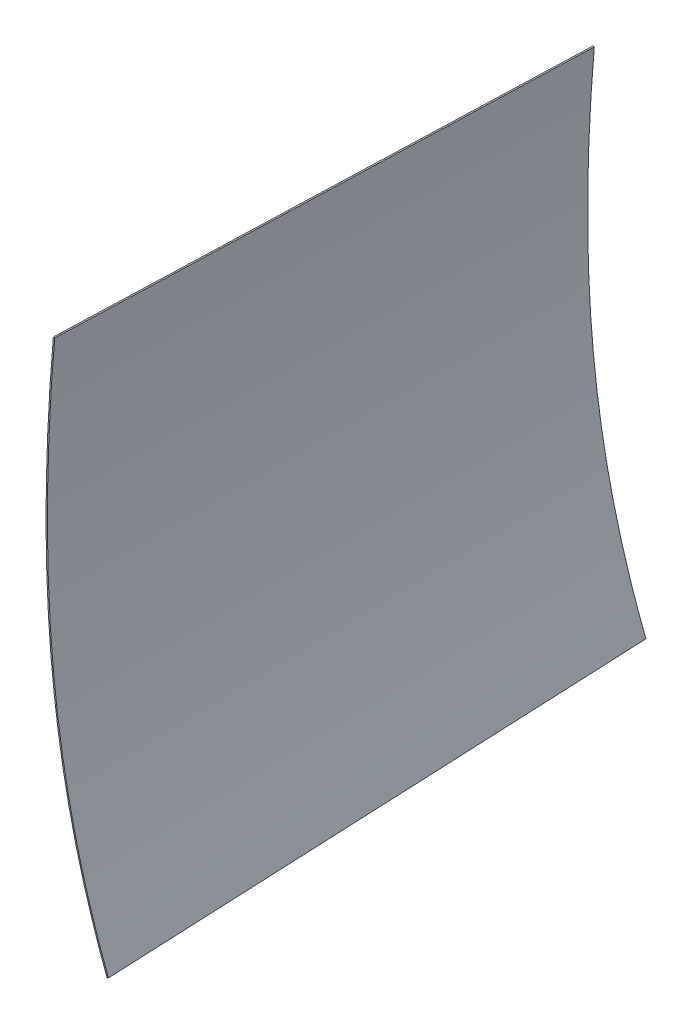
ISO-10303-21;
HEADER;
FILE_DESCRIPTION(('STEP AP214'),'2;1');
FILE_NAME('part.step','',(''),(''),'','','');
FILE_SCHEMA(('AUTOMOTIVE_DESIGN { 1 0 10303 214 1 1 1 1 }'));
ENDSEC;
DATA;
#1=APPLICATION_CONTEXT('core data for automotive mechanical design processes');
#2=APPLICATION_PROTOCOL_DEFINITION('international standard','automotive_design',2000,#1);
#3=PRODUCT_CONTEXT('',#1,'mechanical');
#4=PRODUCT('Part','Part','',(#3));
#5=PRODUCT_RELATED_PRODUCT_CATEGORY('part','',(#4));
#6=PRODUCT_DEFINITION_FORMATION('','',#4);
#7=PRODUCT_DEFINITION_CONTEXT('part definition',#1,'design');
#8=PRODUCT_DEFINITION('design','',#6,#7);
#9=PRODUCT_DEFINITION_SHAPE('','',#8);
#10=(LENGTH_UNIT() NAMED_UNIT(*) SI_UNIT(.MILLI.,.METRE.));
#11=(NAMED_UNIT(*) PLANE_ANGLE_UNIT() SI_UNIT($,.RADIAN.));
#12=(NAMED_UNIT(*) SI_UNIT($,.STERADIAN.) SOLID_ANGLE_UNIT());
#13=UNCERTAINTY_MEASURE_WITH_UNIT(LENGTH_MEASURE(1.E-05),#10,'distance_accuracy_value','');
#14=(GEOMETRIC_REPRESENTATION_CONTEXT(3) GLOBAL_UNCERTAINTY_ASSIGNED_CONTEXT((#13)) GLOBAL_UNIT_ASSIGNED_CONTEXT((#10,
#11,#12)) REPRESENTATION_CONTEXT('',''));
#15=CARTESIAN_POINT('',(0.,0.,0.));
#16=DIRECTION('',(0.,0.,1.));
#17=DIRECTION('',(1.,0.,0.));
#18=AXIS2_PLACEMENT_3D('',#15,#16,#17);
#19=CARTESIAN_POINT('',(-466.611140214616,-2996.06608357652,18.9639705593638));
#20=DIRECTION('',(-0.0340355254361643,0.,0.999420623665675));
#21=DIRECTION('',(0.999420623665674,0.,0.0340355254361653));
#22=AXIS2_PLACEMENT_3D('',#19,#20,#21);
#23=PLANE('',#22);
#24=CARTESIAN_POINT('',(-403.930987283562,-3259.1200239438,21.0985592289505));
#25=CARTESIAN_POINT('',(-445.733833689984,-3153.75817323704,19.67495258278));
#26=CARTESIAN_POINT('',(-468.701212329712,-3041.49687790168,18.8927926179128));
#27=CARTESIAN_POINT('',(-474.470158611015,-2827.19923017659,18.696329674035));
#28=CARTESIAN_POINT('',(-470.849624889443,-2750.93837704815,18.8196278776687));
#29=CARTESIAN_POINT('',(-464.732969148091,-2683.51000000006,19.027932156308));
#30=B_SPLINE_CURVE_WITH_KNOTS('',3,(#24,#25,#26,#27,#28,#29),.UNSPECIFIED.,.F.,.F.,(4,2,4),
(-56.739502562534,-25.56106888728,-9.08244148966291),.UNSPECIFIED.);
#31=CARTESIAN_POINT('',(-403.930987283562,-3259.1200239438,21.0985592289505));
#32=VERTEX_POINT('',#31);
#33=CARTESIAN_POINT('',(-464.732969148085,-2683.51,19.0279321563072));
#34=VERTEX_POINT('',#33);
#35=EDGE_CURVE('E149',#32,#34,#30,.T.);
#36=ORIENTED_EDGE('',*,*,#35,.T.);
#37=DIRECTION('',(-0.995329044093503,0.0903943725162507,-0.0338961856453835));
#38=VECTOR('',#37,1.);
#39=CARTESIAN_POINT('',(-464.732969148085,-2683.51,19.0279321563072));
#40=LINE('',#39,#38);
#41=CARTESIAN_POINT('',(-466.249850611285,-2683.37223897629,18.9762743693844));
#42=VERTEX_POINT('',#41);
#43=EDGE_CURVE('E350',#34,#42,#40,.T.);
#44=ORIENTED_EDGE('',*,*,#43,.T.);
#45=CARTESIAN_POINT('',(-466.249850611285,-2683.37223897629,18.9762743693844));
#46=CARTESIAN_POINT('',(-466.528004547262,-2686.43853357676,18.9668017658189));
#47=CARTESIAN_POINT('',(-467.068754704634,-2692.54817563492,18.9483863806448));
#48=CARTESIAN_POINT('',(-468.112754832755,-2704.96556617701,18.9128326887609));
#49=CARTESIAN_POINT('',(-469.330675907022,-2720.70635667756,18.8713560744898));
#50=CARTESIAN_POINT('',(-470.642951911993,-2739.94017213858,18.8266661788754));
#51=CARTESIAN_POINT('',(-472.173825744941,-2765.96523019636,18.7745318782149));
#52=CARTESIAN_POINT('',(-473.643484071336,-2799.09279437813,18.7244822873156));
#53=CARTESIAN_POINT('',(-474.584547280485,-2839.41721128649,18.6924341385835));
#54=CARTESIAN_POINT('',(-474.597234534269,-2879.89590932481,18.6920020709058));
#55=CARTESIAN_POINT('',(-473.552843034615,-2920.24749419559,18.7275690910473));
#56=CARTESIAN_POINT('',(-471.451298298137,-2959.00502041135,18.7991377355603));
#57=CARTESIAN_POINT('',(-467.251493918511,-3008.90219119633,18.9421631498892));
#58=CARTESIAN_POINT('',(-459.38069233103,-3068.11953927663,19.2102053148107));
#59=CARTESIAN_POINT('',(-445.756996624257,-3135.03979825284,19.6741637631179));
#60=CARTESIAN_POINT('',(-430.934378251679,-3188.07769701693,20.1789518300277));
#61=CARTESIAN_POINT('',(-417.001753178618,-3229.31217603775,20.6534309470667));
#62=CARTESIAN_POINT('',(-409.347475200833,-3249.59842973105,20.9140993449761));
#63=CARTESIAN_POINT('',(-405.346632914116,-3259.68233989391,21.0503490542484));
#64=B_SPLINE_CURVE_WITH_KNOTS('',3,(#45,#46,#47,#48,#49,#50,#51,#52,#53,#54,#55,#56,#57,#58,#59,
#60,#61,#62,#63),.UNSPECIFIED.,.F.,.F.,(4,1,1,1,1,1,1,1,1,1,1,1,1,1,1,1,4),(-56.7395025625342,
-55.9948609832705,-55.2502194040068,-53.7609362454794,-52.271653086952,-50.7823699284246,
-47.8038036113698,-44.8252372943149,-41.8466709772601,-38.8681046602053,-35.8895383431505,
-32.9109720260957,-26.9538393919861,-20.9967067578765,-15.0395741237669,-12.0610078067121,
-9.08244148965729),.UNSPECIFIED.);
#65=CARTESIAN_POINT('',(-405.346632914116,-3259.68233989391,21.0503490542484));
#66=VERTEX_POINT('',#65);
#67=EDGE_CURVE('E106',#42,#66,#64,.T.);
#68=ORIENTED_EDGE('',*,*,#67,.T.);
#69=DIRECTION('',(0.928901332385208,0.368973720543161,0.0316339729013451));
#70=VECTOR('',#69,1.);
#71=CARTESIAN_POINT('',(-403.930987283562,-3259.1200239438,21.0985592289505));
#72=LINE('',#71,#70);
#73=EDGE_CURVE('E13',#66,#32,#72,.T.);
#74=ORIENTED_EDGE('',*,*,#73,.T.);
#75=EDGE_LOOP('',(#36,#44,#68,#74));
#76=FACE_BOUND('',#75,.T.);
#77=ADVANCED_FACE('F96',(#76),#23,.T.);
#78=CARTESIAN_POINT('',(-446.435916270374,-2973.01654152757,-552.449999999998));
#79=DIRECTION('',(0.,0.,1.));
#80=DIRECTION('',(1.,0.,0.));
#81=AXIS2_PLACEMENT_3D('',#78,#79,#80);
#82=PLANE('',#81);
#83=CARTESIAN_POINT('',(-445.271141729746,-2683.51,-552.449999999998));
#84=CARTESIAN_POINT('',(-450.721614948782,-2745.57602142326,-552.449999999999));
#85=CARTESIAN_POINT('',(-453.875260666032,-2815.15896694759,-552.449999999998));
#86=CARTESIAN_POINT('',(-448.538626648829,-3013.430965814,-552.449999999999));
#87=CARTESIAN_POINT('',(-427.328274562893,-3118.30445867765,-552.449999999998));
#88=CARTESIAN_POINT('',(-388.748833209513,-3216.6024410119,-552.449999999999));
#89=B_SPLINE_CURVE_WITH_KNOTS('',3,(#83,#84,#85,#86,#87,#88),.UNSPECIFIED.,.F.,.F.,(4,2,4),
(-53.1349686655124,-38.0838438024245,-9.03456928373366),.UNSPECIFIED.);
#90=CARTESIAN_POINT('',(-445.271141729746,-2683.51,-552.449999999998));
#91=VERTEX_POINT('',#90);
#92=CARTESIAN_POINT('',(-388.748833209513,-3216.6024410119,-552.45));
#93=VERTEX_POINT('',#92);
#94=EDGE_CURVE('E146',#91,#93,#89,.T.);
#95=ORIENTED_EDGE('',*,*,#94,.T.);
#96=DIRECTION('',(-0.930872698143799,-0.365343700986461,0.));
#97=VECTOR('',#96,1.);
#98=CARTESIAN_POINT('',(-388.748833209513,-3216.6024410119,-552.45));
#99=LINE('',#98,#97);
#100=CARTESIAN_POINT('',(-390.167483201485,-3217.1592248122,-552.449999999999));
#101=VERTEX_POINT('',#100);
#102=EDGE_CURVE('E154',#93,#101,#99,.T.);
#103=ORIENTED_EDGE('',*,*,#102,.T.);
#104=CARTESIAN_POINT('',(-390.167483201485,-3217.1592248122,-552.449999999999));
#105=CARTESIAN_POINT('',(-393.835931652239,-3207.81224962655,-552.449999999999));
#106=CARTESIAN_POINT('',(-400.853820334565,-3189.01432562217,-552.449999999999));
#107=CARTESIAN_POINT('',(-413.641001817299,-3150.79551758123,-552.449999999999));
#108=CARTESIAN_POINT('',(-427.264915015272,-3101.64576821892,-552.449999999998));
#109=CARTESIAN_POINT('',(-439.82698408133,-3039.67173926073,-552.449999999998));
#110=CARTESIAN_POINT('',(-447.127533927642,-2984.88729053723,-552.449999999998));
#111=CARTESIAN_POINT('',(-451.061754165715,-2938.77653944781,-552.449999999998));
#112=CARTESIAN_POINT('',(-452.724263374417,-2908.94187235699,-552.449999999997));
#113=CARTESIAN_POINT('',(-453.57787768829,-2884.37336277367,-552.449999999999));
#114=CARTESIAN_POINT('',(-454.106277556635,-2859.4667689179,-552.449999999999));
#115=CARTESIAN_POINT('',(-454.165478379716,-2828.26453296398,-552.449999999999));
#116=CARTESIAN_POINT('',(-453.380335328478,-2790.9185255314,-552.449999999998));
#117=CARTESIAN_POINT('',(-452.093375347344,-2760.19726274656,-552.449999999999));
#118=CARTESIAN_POINT('',(-450.733957511636,-2736.02940774471,-552.449999999999));
#119=CARTESIAN_POINT('',(-449.561553012379,-2718.14988851083,-552.449999999998));
#120=CARTESIAN_POINT('',(-448.468208407524,-2703.49986711604,-552.449999999999));
#121=CARTESIAN_POINT('',(-447.528245891988,-2691.9325270238,-552.449999999999));
#122=CARTESIAN_POINT('',(-447.04033487006,-2686.23529269873,-552.449999999998));
#123=CARTESIAN_POINT('',(-446.789299044502,-2683.37667945526,-552.449999999998));
#124=B_SPLINE_CURVE_WITH_KNOTS('',3,(#104,#105,#106,#107,#108,#109,#110,#111,#112,#113,#114,
#115,#116,#117,#118,#119,#120,#121,#122,#123),.UNSPECIFIED.,.F.,.F.,(4,1,1,1,1,1,1,1,1,1,1,1,1,
1,1,1,1,4),(-53.1349686655124,-50.3786937041512,-47.6224187427901,-42.1098688200677,
-36.5973188973454,-31.084768974623,-28.3284940132619,-25.5722190519007,-24.1940815712201,
-22.8159440905395,-20.0596691291783,-17.3033941678172,-14.547119206456,-13.1689817257754,
-11.7908442450948,-10.4127067644142,-9.72363802407395,-9.03456928373366),.UNSPECIFIED.);
#125=CARTESIAN_POINT('',(-446.789299044502,-2683.37667945526,-552.449999999998));
#126=VERTEX_POINT('',#125);
#127=EDGE_CURVE('E160',#101,#126,#124,.T.);
#128=ORIENTED_EDGE('',*,*,#127,.T.);
#129=DIRECTION('',(0.996166217031828,-0.0874806724053839,0.));
#130=VECTOR('',#129,1.);
#131=CARTESIAN_POINT('',(-445.271141729746,-2683.51,-552.449999999998));
#132=LINE('',#131,#130);
#133=EDGE_CURVE('E166',#126,#91,#132,.T.);
#134=ORIENTED_EDGE('',*,*,#133,.T.);
#135=EDGE_LOOP('',(#95,#103,#128,#134));
#136=FACE_BOUND('',#135,.T.);
#137=ADVANCED_FACE('F164',(#136),#82,.F.);
#138=CARTESIAN_POINT('',(-388.748833209513,-3216.6024410119,-552.449999999999));
#139=CARTESIAN_POINT('',(-393.809551234196,-3230.77496865587,-361.267146923684));
#140=CARTESIAN_POINT('',(-398.87026925888,-3244.94749629983,-170.084293847366));
#141=CARTESIAN_POINT('',(-403.930987283562,-3259.1200239438,21.0985592289505));
#142=CARTESIAN_POINT('',(-396.069879947339,-3197.94887585757,-552.449999999999));
#143=CARTESIAN_POINT('',(-401.352613939788,-3211.62890949383,-361.357814441905));
#144=CARTESIAN_POINT('',(-406.635347932239,-3225.3089431301,-170.265628883808));
#145=CARTESIAN_POINT('',(-411.918081924688,-3238.98897676636,20.8265566742876));
#146=CARTESIAN_POINT('',(-409.462453802419,-3160.1633580475,-552.45));
#147=CARTESIAN_POINT('',(-415.148035207751,-3172.84747091845,-361.52356269192));
#148=CARTESIAN_POINT('',(-420.833616613084,-3185.53158378939,-170.597125383838));
#149=CARTESIAN_POINT('',(-426.519198018416,-3198.21569666032,20.3293119242431));
#150=CARTESIAN_POINT('',(-425.779202527085,-3101.29956753378,-552.449999999998));
#151=CARTESIAN_POINT('',(-431.943278671716,-3112.43172360443,-361.725081639181));
#152=CARTESIAN_POINT('',(-438.107354816347,-3123.56387967509,-171.000163278365));
#153=CARTESIAN_POINT('',(-444.271430960979,-3134.69603574574,19.7247550824509));
#154=CARTESIAN_POINT('',(-436.23479825595,-3049.72310201449,-552.449999999999));
#155=CARTESIAN_POINT('',(-442.694501806463,-3059.47823062877,-361.853838636825));
#156=CARTESIAN_POINT('',(-449.154205356975,-3069.23335924305,-171.257677273652));
#157=CARTESIAN_POINT('',(-455.613908907486,-3078.98848785734,19.3384840895199));
#158=CARTESIAN_POINT('',(-442.695163646224,-3006.60229322653,-552.449999999996));
#159=CARTESIAN_POINT('',(-449.327146150591,-3015.19936674817,-361.933042107012));
#160=CARTESIAN_POINT('',(-455.959128654955,-3023.79644026981,-171.416084214028));
#161=CARTESIAN_POINT('',(-462.591111159321,-3032.39351379145,19.1008736789566));
#162=CARTESIAN_POINT('',(-446.595338289248,-2973.20952160743,-552.449999999999));
#163=CARTESIAN_POINT('',(-453.325842237496,-2980.89808891288,-361.980671095654));
#164=CARTESIAN_POINT('',(-460.056346185744,-2988.58665621832,-171.51134219131));
#165=CARTESIAN_POINT('',(-466.786850133994,-2996.27522352377,18.9579867130352));
#166=CARTESIAN_POINT('',(-449.540346440596,-2938.66280502973,-552.449999999998));
#167=CARTESIAN_POINT('',(-456.337060732767,-2945.40868607614,-362.016356908296));
#168=CARTESIAN_POINT('',(-463.133775024939,-2952.15456712255,-171.582713816593));
#169=CARTESIAN_POINT('',(-469.930489317109,-2958.90044816896,18.8509292751089));
#170=CARTESIAN_POINT('',(-451.535405645622,-2902.92639756038,-552.449999999996));
#171=CARTESIAN_POINT('',(-458.367464028046,-2908.67912835782,-362.04020797783));
#172=CARTESIAN_POINT('',(-465.19952241047,-2914.43185915525,-171.630415955662));
#173=CARTESIAN_POINT('',(-472.031580792895,-2920.18458995269,18.7793760665045));
#174=CARTESIAN_POINT('',(-452.571553541699,-2865.70482179759,-552.449999999998));
#175=CARTESIAN_POINT('',(-459.405821753872,-2870.4300086038,-362.052045328185));
#176=CARTESIAN_POINT('',(-466.240089966044,-2875.15519541001,-171.654090656371));
#177=CARTESIAN_POINT('',(-473.074358178219,-2879.88038221622,18.7438640154411));
#178=CARTESIAN_POINT('',(-452.640725782517,-2828.27319493841,-552.449999999999));
#179=CARTESIAN_POINT('',(-459.447415375371,-2831.9942461404,-362.051891357365));
#180=CARTESIAN_POINT('',(-466.254104968222,-2835.71529734239,-171.653782714736));
#181=CARTESIAN_POINT('',(-473.060794561078,-2839.43634854438,18.7443259278988));
#182=CARTESIAN_POINT('',(-451.857406362839,-2790.96907925551,-552.449999999998));
#183=CARTESIAN_POINT('',(-458.61214151954,-2793.69391470802,-362.041229987878));
#184=CARTESIAN_POINT('',(-465.366876676246,-2796.41875016052,-171.632459975754));
#185=CARTESIAN_POINT('',(-472.12161183295,-2799.14358561301,18.7763100363671));
#186=CARTESIAN_POINT('',(-450.313701225438,-2754.13084657163,-552.449999999998));
#187=CARTESIAN_POINT('',(-456.995351268357,-2755.89498847126,-362.021217297591));
#188=CARTESIAN_POINT('',(-463.677001311277,-2757.65913037089,-171.592434595184));
#189=CARTESIAN_POINT('',(-470.358651354195,-2759.42327227052,18.8363481072216));
#190=CARTESIAN_POINT('',(-448.111630814621,-2718.11246333902,-552.449999999998));
#191=CARTESIAN_POINT('',(-454.7033790296,-2718.95838307462,-361.993158310434));
#192=CARTESIAN_POINT('',(-461.295127244581,-2719.80430281023,-171.536316620869));
#193=CARTESIAN_POINT('',(-467.886875459561,-2720.65022254584,18.9205250686957));
#194=CARTESIAN_POINT('',(-446.269273297842,-2694.87599572167,-552.449999999998));
#195=CARTESIAN_POINT('',(-452.792373822383,-2695.14996441787,-361.969906509969));
#196=CARTESIAN_POINT('',(-459.315474346924,-2695.42393311407,-171.489813019939));
#197=CARTESIAN_POINT('',(-465.838574871468,-2695.69790181027,18.9902804700912));
#198=CARTESIAN_POINT('',(-445.271141729746,-2683.51,-552.449999999998));
#199=CARTESIAN_POINT('',(-451.75841753586,-2683.51000000002,-361.957355947897));
#200=CARTESIAN_POINT('',(-458.245693341977,-2683.51000000004,-171.464711895794));
#201=CARTESIAN_POINT('',(-464.732969148091,-2683.51000000006,19.027932156308));
#202=B_SPLINE_SURFACE_WITH_KNOTS('',3,3,((#138,#139,#140,#141),(#142,#143,#144,#145),(#146,#147,
#148,#149),(#150,#151,#152,#153),(#154,#155,#156,#157),(#158,#159,#160,#161),(#162,#163,#164,
#165),(#166,#167,#168,#169),(#170,#171,#172,#173),(#174,#175,#176,#177),(#178,#179,#180,#181),
(#182,#183,#184,#185),(#186,#187,#188,#189),(#190,#191,#192,#193),(#194,#195,#196,#197),(#198,
#199,#200,#201)),.UNSPECIFIED.,.F.,.F.,.F.,(4,1,1,1,1,1,1,1,1,1,1,1,1,4),(4,4),
(0.501665890350855,0.563957654056998,0.626249417763141,0.688541181469285,0.719687063322356,
0.750832945175428,0.781978827028499,0.813124708881571,0.844270590734642,0.875416472587714,
0.906562354440785,0.937708236293857,0.968854118146928,1.),(0.,1.),.UNSPECIFIED.);
#203=CARTESIAN_POINT('',(-445.271141729746,-2683.51,-552.449999999998));
#204=CARTESIAN_POINT('',(-451.758417535859,-2683.51,-361.957355947897));
#205=CARTESIAN_POINT('',(-458.245693341973,-2683.51,-171.464711895794));
#206=CARTESIAN_POINT('',(-464.732969148085,-2683.51,19.0279321563072));
#207=B_SPLINE_CURVE_WITH_KNOTS('',3,(#203,#204,#205,#206),.UNSPECIFIED.,.F.,.F.,(4,4),(0.,1.),.UNSPECIFIED.);
#208=EDGE_CURVE('E152',#91,#34,#207,.T.);
#209=CARTESIAN_POINT('',(-388.748833209513,-3216.6024410119,-552.449999999999));
#210=CARTESIAN_POINT('',(-393.809551234196,-3230.77496865587,-361.267146923684));
#211=CARTESIAN_POINT('',(-398.87026925888,-3244.94749629983,-170.084293847366));
#212=CARTESIAN_POINT('',(-403.930987283562,-3259.1200239438,21.0985592289505));
#213=B_SPLINE_CURVE_WITH_KNOTS('',3,(#209,#210,#211,#212),.UNSPECIFIED.,.F.,.F.,(4,4),(0.,1.),.UNSPECIFIED.);
#214=EDGE_CURVE('E141',#93,#32,#213,.T.);
#215=ORIENTED_EDGE('',*,*,#94,.F.);
#216=ORIENTED_EDGE('',*,*,#208,.T.);
#217=ORIENTED_EDGE('',*,*,#35,.F.);
#218=ORIENTED_EDGE('',*,*,#214,.F.);
#219=EDGE_LOOP('',(#215,#216,#217,#218));
#220=FACE_BOUND('',#219,.T.);
#221=ADVANCED_FACE('F143',(#220),#202,.T.);
#222=CARTESIAN_POINT('',(-390.167483201485,-3217.1592248122,-552.449999999999));
#223=CARTESIAN_POINT('',(-395.227199772364,-3231.3335965061,-361.283216981916));
#224=CARTESIAN_POINT('',(-400.286916343239,-3245.50796820001,-170.116433963834));
#225=CARTESIAN_POINT('',(-405.346632914116,-3259.68233989391,21.0503490542484));
#226=CARTESIAN_POINT('',(-390.04926236882,-3217.11282616217,-552.449999999999));
#227=CARTESIAN_POINT('',(-395.109062394181,-3231.28704418525,-361.281877810397));
#228=CARTESIAN_POINT('',(-400.168862419544,-3245.46126220833,-170.113755620795));
#229=CARTESIAN_POINT('',(-405.228662444905,-3259.6354802314,21.0543665688068));
#230=CARTESIAN_POINT('',(-389.812820703492,-3217.02002886213,-552.449999999999));
#231=CARTESIAN_POINT('',(-394.872787637823,-3231.19393954354,-361.279199467359));
#232=CARTESIAN_POINT('',(-399.932754572149,-3245.36785022497,-170.108398934718));
#233=CARTESIAN_POINT('',(-404.992721506479,-3259.54176090638,21.0624015979244));
#234=CARTESIAN_POINT('',(-389.458158205498,-3216.88083291205,-552.45));
#235=CARTESIAN_POINT('',(-394.518375503278,-3231.05428258098,-361.275181952799));
#236=CARTESIAN_POINT('',(-399.57859280106,-3245.22773224992,-170.1003639056));
#237=CARTESIAN_POINT('',(-404.638810098837,-3259.40118191886,21.0744541415995));
#238=CARTESIAN_POINT('',(-389.103495707506,-3216.74163696197,-552.449999999999));
#239=CARTESIAN_POINT('',(-394.163963368738,-3230.91462561842,-361.271164438242));
#240=CARTESIAN_POINT('',(-399.224431029971,-3245.08761427488,-170.092328876483));
#241=CARTESIAN_POINT('',(-404.2848986912,-3259.26060293133,21.0865066852746));
#242=CARTESIAN_POINT('',(-388.867054042177,-3216.64883966192,-552.449999999999));
#243=CARTESIAN_POINT('',(-393.927688612377,-3230.82152097671,-361.268486095202));
#244=CARTESIAN_POINT('',(-398.988323182574,-3244.99420229151,-170.086972190406));
#245=CARTESIAN_POINT('',(-404.048957752773,-3259.16688360631,21.0945417143913));
#246=CARTESIAN_POINT('',(-388.748833209513,-3216.6024410119,-552.449999999999));
#247=CARTESIAN_POINT('',(-393.809551234196,-3230.77496865587,-361.267146923684));
#248=CARTESIAN_POINT('',(-398.87026925888,-3244.94749629983,-170.084293847366));
#249=CARTESIAN_POINT('',(-403.930987283562,-3259.1200239438,21.0985592289505));
#250=B_SPLINE_SURFACE_WITH_KNOTS('',3,3,((#222,#223,#224,#225),(#226,#227,#228,#229),(#230,#231,
#232,#233),(#234,#235,#236,#237),(#238,#239,#240,#241),(#242,#243,#244,#245),(#246,#247,#248,
#249)),.UNSPECIFIED.,.F.,.F.,.F.,(4,1,1,1,4),(4,4),(0.500314223497019,0.500652140210478,
0.500990056923937,0.501327973637396,0.501665890350855),(0.,1.),.UNSPECIFIED.);
#251=CARTESIAN_POINT('',(-390.167483201485,-3217.1592248122,-552.449999999999));
#252=CARTESIAN_POINT('',(-395.227199772364,-3231.3335965061,-361.283216981916));
#253=CARTESIAN_POINT('',(-400.286916343239,-3245.50796820001,-170.116433963834));
#254=CARTESIAN_POINT('',(-405.346632914116,-3259.68233989391,21.0503490542484));
#255=B_SPLINE_CURVE_WITH_KNOTS('',3,(#251,#252,#253,#254),.UNSPECIFIED.,.F.,.F.,(4,4),(0.,1.),.UNSPECIFIED.);
#256=EDGE_CURVE('E114',#101,#66,#255,.T.);
#257=ORIENTED_EDGE('',*,*,#102,.F.);
#258=ORIENTED_EDGE('',*,*,#214,.T.);
#259=ORIENTED_EDGE('',*,*,#73,.F.);
#260=ORIENTED_EDGE('',*,*,#256,.F.);
#261=EDGE_LOOP('',(#257,#258,#259,#260));
#262=FACE_BOUND('',#261,.T.);
#263=ADVANCED_FACE('F156',(#262),#250,.T.);
#264=CARTESIAN_POINT('',(-446.789299044502,-2683.37667945526,-552.449999999998));
#265=CARTESIAN_POINT('',(-453.276149566762,-2683.3751992956,-361.974575210205));
#266=CARTESIAN_POINT('',(-459.763000089023,-2683.37371913594,-171.49915042041));
#267=CARTESIAN_POINT('',(-466.249850611285,-2683.37223897629,18.9762743693844));
#268=CARTESIAN_POINT('',(-447.793442346738,-2694.81113242914,-552.449999999998));
#269=CARTESIAN_POINT('',(-454.316450349559,-2695.08656074548,-361.987205348291));
#270=CARTESIAN_POINT('',(-460.839458352381,-2695.36198906182,-171.524410696584));
#271=CARTESIAN_POINT('',(-467.362466355202,-2695.63741737815,18.9383839551223));
#272=CARTESIAN_POINT('',(-449.628368863029,-2717.96540965834,-552.449999999999));
#273=CARTESIAN_POINT('',(-456.2194651953,-2718.80775244859,-362.0103537447));
#274=CARTESIAN_POINT('',(-462.810561527574,-2719.65009523883,-171.570707489401));
#275=CARTESIAN_POINT('',(-469.401657859847,-2720.49243802907,18.8689387658982));
#276=CARTESIAN_POINT('',(-451.83748882108,-2754.07069820279,-552.449999999998));
#277=CARTESIAN_POINT('',(-458.518952553187,-2755.83486527566,-362.038508611739));
#278=CARTESIAN_POINT('',(-465.200416285293,-2757.59903234853,-171.627017223481));
#279=CARTESIAN_POINT('',(-471.8818800174,-2759.36319942139,18.784474164776));
#280=CARTESIAN_POINT('',(-453.379890903247,-2790.91216185459,-552.449999999999));
#281=CARTESIAN_POINT('',(-460.134125474163,-2793.63465413662,-362.05849580735));
#282=CARTESIAN_POINT('',(-466.888360045078,-2796.35714641865,-171.666991614702));
#283=CARTESIAN_POINT('',(-473.642594615994,-2799.07963870068,18.7245125779452));
#284=CARTESIAN_POINT('',(-454.165076006902,-2828.26248199465,-552.449999999997));
#285=CARTESIAN_POINT('',(-460.971635841522,-2831.98363415068,-362.069190984248));
#286=CARTESIAN_POINT('',(-467.778195676139,-2835.7047863067,-171.688381968499));
#287=CARTESIAN_POINT('',(-474.584755510756,-2839.42593846273,18.6924270472497));
#288=CARTESIAN_POINT('',(-454.095941642799,-2865.71985989404,-552.449999999998));
#289=CARTESIAN_POINT('',(-460.929832833652,-2870.44258114125,-362.069336964428));
#290=CARTESIAN_POINT('',(-467.763724024508,-2875.16530238847,-171.688673928856));
#291=CARTESIAN_POINT('',(-474.597615215359,-2879.88802363569,18.6919891067125));
#292=CARTESIAN_POINT('',(-453.05723143814,-2902.99864255074,-552.449999999996));
#293=CARTESIAN_POINT('',(-459.888731722482,-2908.75165394108,-362.057464360764));
#294=CARTESIAN_POINT('',(-466.720232006821,-2914.50466533142,-171.664928721532));
#295=CARTESIAN_POINT('',(-473.551732291161,-2920.25767672176,18.7276069177003));
#296=CARTESIAN_POINT('',(-451.062732070151,-2938.75914982817,-552.449999999998));
#297=CARTESIAN_POINT('',(-457.859652198111,-2945.502386229,-362.033645662327));
#298=CARTESIAN_POINT('',(-464.656572326072,-2952.24562262983,-171.617291324654));
#299=CARTESIAN_POINT('',(-471.453492454031,-2958.98885903067,18.7990630130184));
#300=CARTESIAN_POINT('',(-447.12432554986,-2984.91695503118,-552.449999999996));
#301=CARTESIAN_POINT('',(-453.831634418032,-2992.92491535486,-361.985886113493));
#302=CARTESIAN_POINT('',(-460.538943286203,-3000.93287567854,-171.521772226991));
#303=CARTESIAN_POINT('',(-467.246252154374,-3008.94083600222,18.9423416595105));
#304=CARTESIAN_POINT('',(-439.829755830388,-3039.65121439149,-552.449999999999));
#305=CARTESIAN_POINT('',(-446.348324547407,-3049.13113923506,-361.896652372285));
#306=CARTESIAN_POINT('',(-452.866893264427,-3058.61106407862,-171.34330474457));
#307=CARTESIAN_POINT('',(-459.385461981447,-3068.09098892218,19.2100428831434));
#308=CARTESIAN_POINT('',(-427.263866015607,-3101.65436833451,-552.449999999998));
#309=CARTESIAN_POINT('',(-433.427342920815,-3112.78755377607,-361.741914763775));
#310=CARTESIAN_POINT('',(-439.590819826022,-3123.92073921762,-171.033829527554));
#311=CARTESIAN_POINT('',(-445.754296731227,-3135.05392465918,19.674255708666));
#312=CARTESIAN_POINT('',(-410.914916681467,-3160.62625565427,-552.450000000002));
#313=CARTESIAN_POINT('',(-416.600100211762,-3173.31102152984,-361.540037140693));
#314=CARTESIAN_POINT('',(-422.285283742055,-3185.99578740541,-170.630074281387));
#315=CARTESIAN_POINT('',(-427.970467272349,-3198.68055328098,20.2798885779192));
#316=CARTESIAN_POINT('',(-397.504380102991,-3198.4652744409,-552.450000000002));
#317=CARTESIAN_POINT('',(-402.78569256451,-3212.14835614999,-361.374050121431));
#318=CARTESIAN_POINT('',(-408.067005026028,-3225.8314378591,-170.298100242864));
#319=CARTESIAN_POINT('',(-413.348317487545,-3239.5145195682,20.7778496357029));
#320=CARTESIAN_POINT('',(-390.167483201485,-3217.1592248122,-552.449999999999));
#321=CARTESIAN_POINT('',(-395.227199772364,-3231.3335965061,-361.283216981916));
#322=CARTESIAN_POINT('',(-400.286916343239,-3245.50796820001,-170.116433963834));
#323=CARTESIAN_POINT('',(-405.346632914116,-3259.68233989391,21.0503490542484));
#324=B_SPLINE_SURFACE_WITH_KNOTS('',3,3,((#264,#265,#266,#267),(#268,#269,#270,#271),(#272,#273,
#274,#275),(#276,#277,#278,#279),(#280,#281,#282,#283),(#284,#285,#286,#287),(#288,#289,#290,
#291),(#292,#293,#294,#295),(#296,#297,#298,#299),(#300,#301,#302,#303),(#304,#305,#306,#307),
(#308,#309,#310,#311),(#312,#313,#314,#315),(#316,#317,#318,#319),(#320,#321,#322,#323)),
.UNSPECIFIED.,.F.,.F.,.F.,(4,1,1,1,1,1,1,1,1,1,1,1,4),(4,4),(0.00135166685383582,
0.0325368266440348,0.0637219864342337,0.0949071462244327,0.126092306014632,0.157277465804831,
0.18846262559503,0.219647785385229,0.250832945175428,0.313203264755826,0.375573584336223,
0.437943903916621,0.500314223497019),(0.,1.),.UNSPECIFIED.);
#325=CARTESIAN_POINT('',(-446.789299044502,-2683.37667945526,-552.449999999998));
#326=CARTESIAN_POINT('',(-453.276149566762,-2683.3751992956,-361.974575210205));
#327=CARTESIAN_POINT('',(-459.763000089023,-2683.37371913594,-171.49915042041));
#328=CARTESIAN_POINT('',(-466.249850611285,-2683.37223897629,18.9762743693844));
#329=B_SPLINE_CURVE_WITH_KNOTS('',3,(#325,#326,#327,#328),.UNSPECIFIED.,.F.,.F.,(4,4),(0.,1.),.UNSPECIFIED.);
#330=EDGE_CURVE('E159',#126,#42,#329,.T.);
#331=ORIENTED_EDGE('',*,*,#127,.F.);
#332=ORIENTED_EDGE('',*,*,#256,.T.);
#333=ORIENTED_EDGE('',*,*,#67,.F.);
#334=ORIENTED_EDGE('',*,*,#330,.F.);
#335=EDGE_LOOP('',(#331,#332,#333,#334));
#336=FACE_BOUND('',#335,.T.);
#337=ADVANCED_FACE('F234',(#336),#324,.T.);
#338=CARTESIAN_POINT('',(-445.271141729746,-2683.51,-552.449999999998));
#339=CARTESIAN_POINT('',(-451.758417535859,-2683.51,-361.957355947897));
#340=CARTESIAN_POINT('',(-458.245693341973,-2683.51,-171.464711895794));
#341=CARTESIAN_POINT('',(-464.732969148085,-2683.51,19.0279321563072));
#342=CARTESIAN_POINT('',(-445.397654839308,-2683.49888995461,-552.449999999999));
#343=CARTESIAN_POINT('',(-451.884895205101,-2683.49876660797,-361.958790886422));
#344=CARTESIAN_POINT('',(-458.372135570894,-2683.49864326133,-171.467581772847));
#345=CARTESIAN_POINT('',(-464.859375936685,-2683.49851991469,19.0236273407312));
#346=CARTESIAN_POINT('',(-445.650681058436,-2683.47666986381,-552.449999999998));
#347=CARTESIAN_POINT('',(-452.137850543585,-2683.4762998239,-361.961660763474));
#348=CARTESIAN_POINT('',(-458.625020028735,-2683.47592978399,-171.473321526948));
#349=CARTESIAN_POINT('',(-465.112189513885,-2683.47555974407,19.0150177095774));
#350=CARTESIAN_POINT('',(-446.030220387125,-2683.44333972763,-552.449999999998));
#351=CARTESIAN_POINT('',(-452.51728355131,-2683.4425996478,-361.965965579051));
#352=CARTESIAN_POINT('',(-459.004346715499,-2683.44185956797,-171.481931158102));
#353=CARTESIAN_POINT('',(-465.491409879685,-2683.44111948815,19.0021032628458));
#354=CARTESIAN_POINT('',(-446.409759715813,-2683.41000959144,-552.449999999998));
#355=CARTESIAN_POINT('',(-452.896716559037,-2683.4088994717,-361.970270394627));
#356=CARTESIAN_POINT('',(-459.38367340226,-2683.40778935196,-171.490540789256));
#357=CARTESIAN_POINT('',(-465.870630245485,-2683.40667923221,18.9891888161151));
#358=CARTESIAN_POINT('',(-446.662785934939,-2683.38778950065,-552.449999999998));
#359=CARTESIAN_POINT('',(-453.14967189752,-2683.38643268764,-361.973140271679));
#360=CARTESIAN_POINT('',(-459.636557860102,-2683.38507587461,-171.49628054336));
#361=CARTESIAN_POINT('',(-466.123443822684,-2683.3837190616,18.9805791849613));
#362=CARTESIAN_POINT('',(-446.789299044502,-2683.37667945526,-552.449999999998));
#363=CARTESIAN_POINT('',(-453.276149566762,-2683.3751992956,-361.974575210205));
#364=CARTESIAN_POINT('',(-459.763000089023,-2683.37371913594,-171.49915042041));
#365=CARTESIAN_POINT('',(-466.249850611285,-2683.37223897629,18.9762743693844));
#366=B_SPLINE_SURFACE_WITH_KNOTS('',3,3,((#338,#339,#340,#341),(#342,#343,#344,#345),(#346,#347,
#348,#349),(#350,#351,#352,#353),(#354,#355,#356,#357),(#358,#359,#360,#361),(#362,#363,#364,
#365)),.UNSPECIFIED.,.F.,.F.,.F.,(4,1,1,1,4),(4,4),(0.,0.000337916713458955,0.00067583342691791,
0.00101375014037687,0.00135166685383582),(0.,1.),.UNSPECIFIED.);
#367=ORIENTED_EDGE('',*,*,#133,.F.);
#368=ORIENTED_EDGE('',*,*,#330,.T.);
#369=ORIENTED_EDGE('',*,*,#43,.F.);
#370=ORIENTED_EDGE('',*,*,#208,.F.);
#371=EDGE_LOOP('',(#367,#368,#369,#370));
#372=FACE_BOUND('',#371,.T.);
#373=ADVANCED_FACE('F189',(#372),#366,.T.);
#374=CLOSED_SHELL('',(#77,#137,#221,#263,#337,#373));
#375=MANIFOLD_SOLID_BREP('B2',#374);
#376=ADVANCED_BREP_SHAPE_REPRESENTATION('',(#18,#375),#14);
#377=SHAPE_DEFINITION_REPRESENTATION(#9,#376);
ENDSEC;
END-ISO-10303-21;
